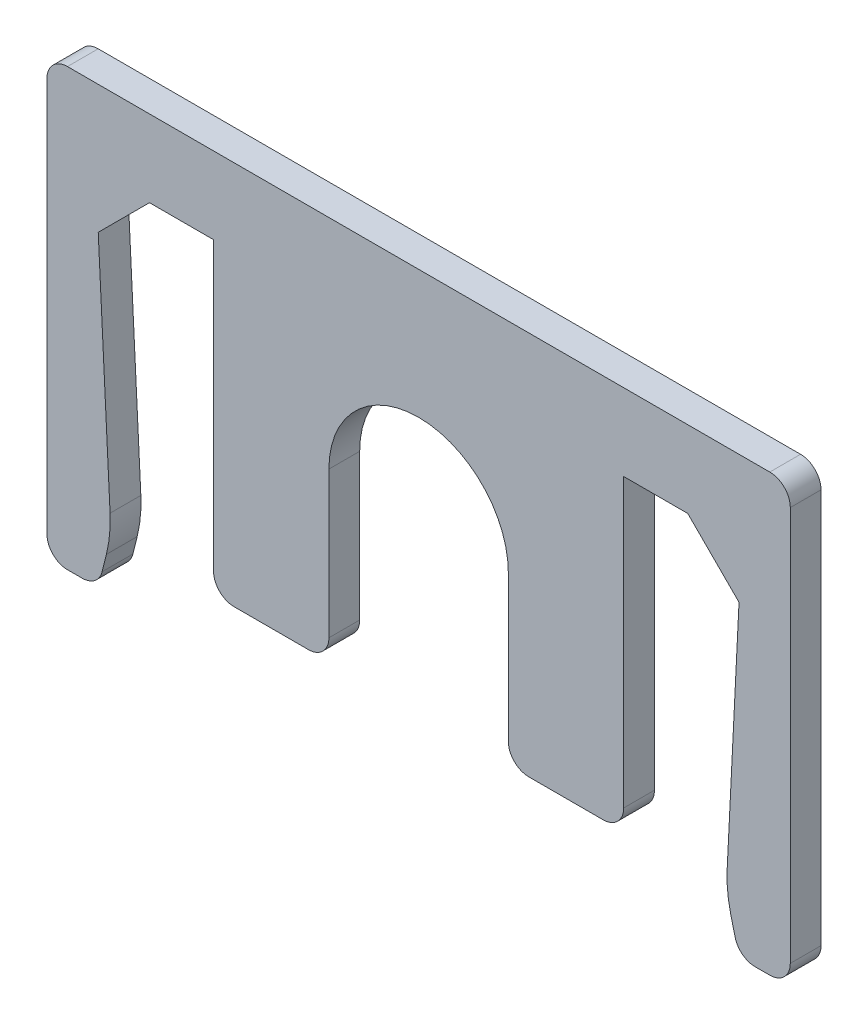
ISO-10303-21;
HEADER;
FILE_DESCRIPTION(('STEP AP214'),'2;1');
FILE_NAME('part.step','',(''),(''),'','','');
FILE_SCHEMA(('AUTOMOTIVE_DESIGN { 1 0 10303 214 1 1 1 1 }'));
ENDSEC;
DATA;
#1=APPLICATION_CONTEXT('core data for automotive mechanical design processes');
#2=APPLICATION_PROTOCOL_DEFINITION('international standard','automotive_design',2000,#1);
#3=PRODUCT_CONTEXT('',#1,'mechanical');
#4=PRODUCT('Part','Part','',(#3));
#5=PRODUCT_RELATED_PRODUCT_CATEGORY('part','',(#4));
#6=PRODUCT_DEFINITION_FORMATION('','',#4);
#7=PRODUCT_DEFINITION_CONTEXT('part definition',#1,'design');
#8=PRODUCT_DEFINITION('design','',#6,#7);
#9=PRODUCT_DEFINITION_SHAPE('','',#8);
#10=(LENGTH_UNIT() NAMED_UNIT(*) SI_UNIT(.MILLI.,.METRE.));
#11=(NAMED_UNIT(*) PLANE_ANGLE_UNIT() SI_UNIT($,.RADIAN.));
#12=(NAMED_UNIT(*) SI_UNIT($,.STERADIAN.) SOLID_ANGLE_UNIT());
#13=UNCERTAINTY_MEASURE_WITH_UNIT(LENGTH_MEASURE(1.E-05),#10,'distance_accuracy_value','');
#14=(GEOMETRIC_REPRESENTATION_CONTEXT(3) GLOBAL_UNCERTAINTY_ASSIGNED_CONTEXT((#13)) GLOBAL_UNIT_ASSIGNED_CONTEXT((#10,
#11,#12)) REPRESENTATION_CONTEXT('',''));
#15=CARTESIAN_POINT('',(0.,0.,0.));
#16=DIRECTION('',(0.,0.,1.));
#17=DIRECTION('',(1.,0.,0.));
#18=AXIS2_PLACEMENT_3D('',#15,#16,#17);
#19=CARTESIAN_POINT('',(-10.5,0.,1.2));
#20=DIRECTION('',(0.,1.,0.));
#21=DIRECTION('',(-1.,0.,0.));
#22=AXIS2_PLACEMENT_3D('',#19,#20,#21);
#23=PLANE('',#22);
#24=DIRECTION('',(1.,0.,0.));
#25=VECTOR('',#24,1.);
#26=CARTESIAN_POINT('',(-10.5,0.,0.));
#27=LINE('',#26,#25);
#28=CARTESIAN_POINT('',(-10.5,0.,0.));
#29=VERTEX_POINT('',#28);
#30=CARTESIAN_POINT('',(-8.,0.,0.));
#31=VERTEX_POINT('',#30);
#32=EDGE_CURVE('E277',#29,#31,#27,.T.);
#33=ORIENTED_EDGE('',*,*,#32,.T.);
#34=DIRECTION('',(0.,0.,-1.));
#35=VECTOR('',#34,1.);
#36=CARTESIAN_POINT('',(-8.,0.,1.2));
#37=LINE('',#36,#35);
#38=CARTESIAN_POINT('',(-8.,0.,1.2));
#39=VERTEX_POINT('',#38);
#40=EDGE_CURVE('E256',#39,#31,#37,.T.);
#41=ORIENTED_EDGE('',*,*,#40,.F.);
#42=DIRECTION('',(1.,0.,0.));
#43=VECTOR('',#42,1.);
#44=CARTESIAN_POINT('',(-10.5,0.,1.2));
#45=LINE('',#44,#43);
#46=CARTESIAN_POINT('',(-10.5,0.,1.2));
#47=VERTEX_POINT('',#46);
#48=EDGE_CURVE('E263',#47,#39,#45,.T.);
#49=ORIENTED_EDGE('',*,*,#48,.F.);
#50=DIRECTION('',(0.,0.,-1.));
#51=VECTOR('',#50,1.);
#52=CARTESIAN_POINT('',(-10.5,0.,1.2));
#53=LINE('',#52,#51);
#54=EDGE_CURVE('E518',#47,#29,#53,.T.);
#55=ORIENTED_EDGE('',*,*,#54,.T.);
#56=EDGE_LOOP('',(#33,#41,#49,#55));
#57=FACE_BOUND('',#56,.T.);
#58=ADVANCED_FACE('F39',(#57),#23,.F.);
#59=CARTESIAN_POINT('',(-8.,-12.,1.2));
#60=DIRECTION('',(1.,0.,0.));
#61=DIRECTION('',(0.,0.,-1.));
#62=AXIS2_PLACEMENT_3D('',#59,#60,#61);
#63=PLANE('',#62);
#64=DIRECTION('',(0.,-1.,0.));
#65=VECTOR('',#64,1.);
#66=CARTESIAN_POINT('',(-8.,-12.,0.));
#67=LINE('',#66,#65);
#68=CARTESIAN_POINT('',(-8.,-11.2,0.));
#69=VERTEX_POINT('',#68);
#70=EDGE_CURVE('E549',#31,#69,#67,.T.);
#71=ORIENTED_EDGE('',*,*,#70,.T.);
#72=DIRECTION('',(0.,0.,-1.));
#73=VECTOR('',#72,1.);
#74=CARTESIAN_POINT('',(-8.,-11.2,1.2));
#75=LINE('',#74,#73);
#76=CARTESIAN_POINT('',(-8.,-11.2,1.2));
#77=VERTEX_POINT('',#76);
#78=EDGE_CURVE('E259',#69,#77,#75,.F.);
#79=ORIENTED_EDGE('',*,*,#78,.T.);
#80=DIRECTION('',(0.,-1.,0.));
#81=VECTOR('',#80,1.);
#82=CARTESIAN_POINT('',(-8.,-12.,1.2));
#83=LINE('',#82,#81);
#84=EDGE_CURVE('E251',#39,#77,#83,.T.);
#85=ORIENTED_EDGE('',*,*,#84,.F.);
#86=ORIENTED_EDGE('',*,*,#40,.T.);
#87=EDGE_LOOP('',(#71,#79,#85,#86));
#88=FACE_BOUND('',#87,.T.);
#89=ADVANCED_FACE('F254',(#88),#63,.F.);
#90=CARTESIAN_POINT('',(-8.,-12.,1.2));
#91=DIRECTION('',(0.,1.,0.));
#92=DIRECTION('',(-1.,0.,0.));
#93=AXIS2_PLACEMENT_3D('',#90,#91,#92);
#94=PLANE('',#93);
#95=DIRECTION('',(1.,0.,0.));
#96=VECTOR('',#95,1.);
#97=CARTESIAN_POINT('',(-8.,-12.,1.2));
#98=LINE('',#97,#96);
#99=CARTESIAN_POINT('',(-7.2,-12.,1.2));
#100=VERTEX_POINT('',#99);
#101=CARTESIAN_POINT('',(-4.3,-12.,1.2));
#102=VERTEX_POINT('',#101);
#103=EDGE_CURVE('E262',#100,#102,#98,.T.);
#104=ORIENTED_EDGE('',*,*,#103,.F.);
#105=DIRECTION('',(0.,0.,-1.));
#106=VECTOR('',#105,1.);
#107=CARTESIAN_POINT('',(-7.2,-12.,1.2));
#108=LINE('',#107,#106);
#109=CARTESIAN_POINT('',(-7.2,-12.,0.));
#110=VERTEX_POINT('',#109);
#111=EDGE_CURVE('E418',#100,#110,#108,.T.);
#112=ORIENTED_EDGE('',*,*,#111,.T.);
#113=DIRECTION('',(1.,0.,0.));
#114=VECTOR('',#113,1.);
#115=CARTESIAN_POINT('',(-8.,-12.,0.));
#116=LINE('',#115,#114);
#117=CARTESIAN_POINT('',(-4.3,-12.,0.));
#118=VERTEX_POINT('',#117);
#119=EDGE_CURVE('E543',#110,#118,#116,.T.);
#120=ORIENTED_EDGE('',*,*,#119,.T.);
#121=DIRECTION('',(0.,0.,-1.));
#122=VECTOR('',#121,1.);
#123=CARTESIAN_POINT('',(-4.3,-12.,1.2));
#124=LINE('',#123,#122);
#125=EDGE_CURVE('E415',#118,#102,#124,.F.);
#126=ORIENTED_EDGE('',*,*,#125,.T.);
#127=EDGE_LOOP('',(#104,#112,#120,#126));
#128=FACE_BOUND('',#127,.T.);
#129=ADVANCED_FACE('F624',(#128),#94,.F.);
#130=CARTESIAN_POINT('',(-3.5,-5.5,1.2));
#131=DIRECTION('',(-1.,0.,0.));
#132=DIRECTION('',(0.,-1.,0.));
#133=AXIS2_PLACEMENT_3D('',#130,#131,#132);
#134=PLANE('',#133);
#135=DIRECTION('',(0.,1.,0.));
#136=VECTOR('',#135,1.);
#137=CARTESIAN_POINT('',(-3.5,-5.5,1.2));
#138=LINE('',#137,#136);
#139=CARTESIAN_POINT('',(-3.5,-11.2,1.2));
#140=VERTEX_POINT('',#139);
#141=CARTESIAN_POINT('',(-3.5,-5.5,1.2));
#142=VERTEX_POINT('',#141);
#143=EDGE_CURVE('E600',#140,#142,#138,.T.);
#144=ORIENTED_EDGE('',*,*,#143,.F.);
#145=DIRECTION('',(0.,0.,-1.));
#146=VECTOR('',#145,1.);
#147=CARTESIAN_POINT('',(-3.5,-11.2,1.2));
#148=LINE('',#147,#146);
#149=CARTESIAN_POINT('',(-3.5,-11.2,0.));
#150=VERTEX_POINT('',#149);
#151=EDGE_CURVE('E11',#140,#150,#148,.T.);
#152=ORIENTED_EDGE('',*,*,#151,.T.);
#153=DIRECTION('',(0.,1.,0.));
#154=VECTOR('',#153,1.);
#155=CARTESIAN_POINT('',(-3.5,-5.5,0.));
#156=LINE('',#155,#154);
#157=CARTESIAN_POINT('',(-3.5,-5.5,0.));
#158=VERTEX_POINT('',#157);
#159=EDGE_CURVE('E540',#150,#158,#156,.T.);
#160=ORIENTED_EDGE('',*,*,#159,.T.);
#161=DIRECTION('',(0.,0.,-1.));
#162=VECTOR('',#161,1.);
#163=CARTESIAN_POINT('',(-3.5,-5.5,1.2));
#164=LINE('',#163,#162);
#165=EDGE_CURVE('E280',#142,#158,#164,.T.);
#166=ORIENTED_EDGE('',*,*,#165,.F.);
#167=EDGE_LOOP('',(#144,#152,#160,#166));
#168=FACE_BOUND('',#167,.T.);
#169=ADVANCED_FACE('F614',(#168),#134,.F.);
#170=CARTESIAN_POINT('',(0.,-5.5,1.2));
#171=DIRECTION('',(0.,0.,-1.));
#172=DIRECTION('',(-1.,0.,0.));
#173=AXIS2_PLACEMENT_3D('',#170,#171,#172);
#174=CYLINDRICAL_SURFACE('',#173,3.5);
#175=CARTESIAN_POINT('',(0.,-5.5,0.));
#176=DIRECTION('',(0.,0.,-1.));
#177=DIRECTION('',(1.,0.,0.));
#178=AXIS2_PLACEMENT_3D('',#175,#176,#177);
#179=CIRCLE('',#178,3.5);
#180=CARTESIAN_POINT('',(3.5,-5.5,0.));
#181=VERTEX_POINT('',#180);
#182=EDGE_CURVE('E474',#158,#181,#179,.T.);
#183=ORIENTED_EDGE('',*,*,#182,.T.);
#184=DIRECTION('',(0.,0.,-1.));
#185=VECTOR('',#184,1.);
#186=CARTESIAN_POINT('',(3.5,-5.5,1.2));
#187=LINE('',#186,#185);
#188=CARTESIAN_POINT('',(3.5,-5.5,1.2));
#189=VERTEX_POINT('',#188);
#190=EDGE_CURVE('E288',#189,#181,#187,.T.);
#191=ORIENTED_EDGE('',*,*,#190,.F.);
#192=CARTESIAN_POINT('',(0.,-5.5,1.2));
#193=DIRECTION('',(0.,0.,-1.));
#194=DIRECTION('',(1.,0.,0.));
#195=AXIS2_PLACEMENT_3D('',#192,#193,#194);
#196=CIRCLE('',#195,3.5);
#197=EDGE_CURVE('E450',#142,#189,#196,.T.);
#198=ORIENTED_EDGE('',*,*,#197,.F.);
#199=ORIENTED_EDGE('',*,*,#165,.T.);
#200=EDGE_LOOP('',(#183,#191,#198,#199));
#201=FACE_BOUND('',#200,.T.);
#202=ADVANCED_FACE('F616',(#201),#174,.F.);
#203=CARTESIAN_POINT('',(3.5,-5.5,1.2));
#204=DIRECTION('',(1.,0.,0.));
#205=DIRECTION('',(0.,1.,0.));
#206=AXIS2_PLACEMENT_3D('',#203,#204,#205);
#207=PLANE('',#206);
#208=DIRECTION('',(0.,-1.,0.));
#209=VECTOR('',#208,1.);
#210=CARTESIAN_POINT('',(3.5,-5.5,0.));
#211=LINE('',#210,#209);
#212=CARTESIAN_POINT('',(3.5,-11.2,0.));
#213=VERTEX_POINT('',#212);
#214=EDGE_CURVE('E444',#181,#213,#211,.T.);
#215=ORIENTED_EDGE('',*,*,#214,.T.);
#216=DIRECTION('',(0.,0.,-1.));
#217=VECTOR('',#216,1.);
#218=CARTESIAN_POINT('',(3.5,-11.2,1.2));
#219=LINE('',#218,#217);
#220=CARTESIAN_POINT('',(3.5,-11.2,1.2));
#221=VERTEX_POINT('',#220);
#222=EDGE_CURVE('E48',#213,#221,#219,.F.);
#223=ORIENTED_EDGE('',*,*,#222,.T.);
#224=DIRECTION('',(0.,-1.,0.));
#225=VECTOR('',#224,1.);
#226=CARTESIAN_POINT('',(3.5,-5.5,1.2));
#227=LINE('',#226,#225);
#228=EDGE_CURVE('E442',#189,#221,#227,.T.);
#229=ORIENTED_EDGE('',*,*,#228,.F.);
#230=ORIENTED_EDGE('',*,*,#190,.T.);
#231=EDGE_LOOP('',(#215,#223,#229,#230));
#232=FACE_BOUND('',#231,.T.);
#233=ADVANCED_FACE('F440',(#232),#207,.F.);
#234=CARTESIAN_POINT('',(3.5,-12.,1.2));
#235=DIRECTION('',(0.,1.,0.));
#236=DIRECTION('',(-1.,0.,0.));
#237=AXIS2_PLACEMENT_3D('',#234,#235,#236);
#238=PLANE('',#237);
#239=DIRECTION('',(1.,0.,0.));
#240=VECTOR('',#239,1.);
#241=CARTESIAN_POINT('',(3.5,-12.,0.));
#242=LINE('',#241,#240);
#243=CARTESIAN_POINT('',(4.3,-12.,0.));
#244=VERTEX_POINT('',#243);
#245=CARTESIAN_POINT('',(7.2,-12.,0.));
#246=VERTEX_POINT('',#245);
#247=EDGE_CURVE('E461',#244,#246,#242,.T.);
#248=ORIENTED_EDGE('',*,*,#247,.T.);
#249=DIRECTION('',(0.,0.,-1.));
#250=VECTOR('',#249,1.);
#251=CARTESIAN_POINT('',(7.2,-12.,1.2));
#252=LINE('',#251,#250);
#253=CARTESIAN_POINT('',(7.2,-12.,1.2));
#254=VERTEX_POINT('',#253);
#255=EDGE_CURVE('E432',#246,#254,#252,.F.);
#256=ORIENTED_EDGE('',*,*,#255,.T.);
#257=DIRECTION('',(1.,0.,0.));
#258=VECTOR('',#257,1.);
#259=CARTESIAN_POINT('',(3.5,-12.,1.2));
#260=LINE('',#259,#258);
#261=CARTESIAN_POINT('',(4.3,-12.,1.2));
#262=VERTEX_POINT('',#261);
#263=EDGE_CURVE('E453',#262,#254,#260,.T.);
#264=ORIENTED_EDGE('',*,*,#263,.F.);
#265=DIRECTION('',(0.,0.,-1.));
#266=VECTOR('',#265,1.);
#267=CARTESIAN_POINT('',(4.3,-12.,1.2));
#268=LINE('',#267,#266);
#269=EDGE_CURVE('E428',#262,#244,#268,.T.);
#270=ORIENTED_EDGE('',*,*,#269,.T.);
#271=EDGE_LOOP('',(#248,#256,#264,#270));
#272=FACE_BOUND('',#271,.T.);
#273=ADVANCED_FACE('F460',(#272),#238,.F.);
#274=CARTESIAN_POINT('',(8.,-12.,1.2));
#275=DIRECTION('',(-1.,0.,0.));
#276=DIRECTION('',(0.,0.,1.));
#277=AXIS2_PLACEMENT_3D('',#274,#275,#276);
#278=PLANE('',#277);
#279=DIRECTION('',(0.,1.,0.));
#280=VECTOR('',#279,1.);
#281=CARTESIAN_POINT('',(8.,-12.,1.2));
#282=LINE('',#281,#280);
#283=CARTESIAN_POINT('',(8.,-11.2,1.2));
#284=VERTEX_POINT('',#283);
#285=CARTESIAN_POINT('',(8.,0.,1.2));
#286=VERTEX_POINT('',#285);
#287=EDGE_CURVE('E593',#284,#286,#282,.T.);
#288=ORIENTED_EDGE('',*,*,#287,.F.);
#289=DIRECTION('',(0.,0.,-1.));
#290=VECTOR('',#289,1.);
#291=CARTESIAN_POINT('',(8.,-11.2,1.2));
#292=LINE('',#291,#290);
#293=CARTESIAN_POINT('',(8.,-11.2,0.));
#294=VERTEX_POINT('',#293);
#295=EDGE_CURVE('E424',#284,#294,#292,.T.);
#296=ORIENTED_EDGE('',*,*,#295,.T.);
#297=DIRECTION('',(0.,1.,0.));
#298=VECTOR('',#297,1.);
#299=CARTESIAN_POINT('',(8.,-12.,0.));
#300=LINE('',#299,#298);
#301=CARTESIAN_POINT('',(8.,0.,0.));
#302=VERTEX_POINT('',#301);
#303=EDGE_CURVE('E468',#294,#302,#300,.T.);
#304=ORIENTED_EDGE('',*,*,#303,.T.);
#305=DIRECTION('',(0.,0.,-1.));
#306=VECTOR('',#305,1.);
#307=CARTESIAN_POINT('',(8.,0.,1.2));
#308=LINE('',#307,#306);
#309=EDGE_CURVE('E533',#286,#302,#308,.T.);
#310=ORIENTED_EDGE('',*,*,#309,.F.);
#311=EDGE_LOOP('',(#288,#296,#304,#310));
#312=FACE_BOUND('',#311,.T.);
#313=ADVANCED_FACE('F834',(#312),#278,.F.);
#314=CARTESIAN_POINT('',(8.,0.,1.2));
#315=DIRECTION('',(0.,1.,0.));
#316=DIRECTION('',(-1.,0.,0.));
#317=AXIS2_PLACEMENT_3D('',#314,#315,#316);
#318=PLANE('',#317);
#319=DIRECTION('',(1.,0.,0.));
#320=VECTOR('',#319,1.);
#321=CARTESIAN_POINT('',(8.,0.,0.));
#322=LINE('',#321,#320);
#323=CARTESIAN_POINT('',(10.5,0.,0.));
#324=VERTEX_POINT('',#323);
#325=EDGE_CURVE('E472',#302,#324,#322,.T.);
#326=ORIENTED_EDGE('',*,*,#325,.T.);
#327=DIRECTION('',(0.,0.,-1.));
#328=VECTOR('',#327,1.);
#329=CARTESIAN_POINT('',(10.5,0.,1.2));
#330=LINE('',#329,#328);
#331=CARTESIAN_POINT('',(10.5,0.,1.2));
#332=VERTEX_POINT('',#331);
#333=EDGE_CURVE('E529',#332,#324,#330,.T.);
#334=ORIENTED_EDGE('',*,*,#333,.F.);
#335=DIRECTION('',(1.,0.,0.));
#336=VECTOR('',#335,1.);
#337=CARTESIAN_POINT('',(8.,0.,1.2));
#338=LINE('',#337,#336);
#339=EDGE_CURVE('E590',#286,#332,#338,.T.);
#340=ORIENTED_EDGE('',*,*,#339,.F.);
#341=ORIENTED_EDGE('',*,*,#309,.T.);
#342=EDGE_LOOP('',(#326,#334,#340,#341));
#343=FACE_BOUND('',#342,.T.);
#344=ADVANCED_FACE('F839',(#343),#318,.F.);
#345=CARTESIAN_POINT('',(12.5,-2.,1.2));
#346=DIRECTION('',(0.707106781186547,0.707106781186548,0.));
#347=DIRECTION('',(-0.707106781186548,0.707106781186547,0.));
#348=AXIS2_PLACEMENT_3D('',#345,#346,#347);
#349=PLANE('',#348);
#350=DIRECTION('',(0.707106781186548,-0.707106781186547,0.));
#351=VECTOR('',#350,1.);
#352=CARTESIAN_POINT('',(12.5,-2.,0.));
#353=LINE('',#352,#351);
#354=CARTESIAN_POINT('',(12.5,-2.,0.));
#355=VERTEX_POINT('',#354);
#356=EDGE_CURVE('E480',#324,#355,#353,.T.);
#357=ORIENTED_EDGE('',*,*,#356,.T.);
#358=DIRECTION('',(0.,0.,-1.));
#359=VECTOR('',#358,1.);
#360=CARTESIAN_POINT('',(12.5,-2.,1.2));
#361=LINE('',#360,#359);
#362=CARTESIAN_POINT('',(12.5,-2.,1.2));
#363=VERTEX_POINT('',#362);
#364=EDGE_CURVE('E525',#363,#355,#361,.T.);
#365=ORIENTED_EDGE('',*,*,#364,.F.);
#366=DIRECTION('',(0.707106781186548,-0.707106781186547,0.));
#367=VECTOR('',#366,1.);
#368=CARTESIAN_POINT('',(12.5,-2.,1.2));
#369=LINE('',#368,#367);
#370=EDGE_CURVE('E587',#332,#363,#369,.T.);
#371=ORIENTED_EDGE('',*,*,#370,.F.);
#372=ORIENTED_EDGE('',*,*,#333,.T.);
#373=EDGE_LOOP('',(#357,#365,#371,#372));
#374=FACE_BOUND('',#373,.T.);
#375=ADVANCED_FACE('F901',(#374),#349,.F.);
#376=CARTESIAN_POINT('',(12.,-12.,1.2));
#377=DIRECTION('',(0.998752338877844,-0.0499376169438947,0.));
#378=DIRECTION('',(0.0499376169438947,0.998752338877845,0.));
#379=AXIS2_PLACEMENT_3D('',#376,#377,#378);
#380=PLANE('',#379);
#381=DIRECTION('',(-0.0499376169438947,-0.998752338877845,0.));
#382=VECTOR('',#381,1.);
#383=CARTESIAN_POINT('',(12.,-12.,0.));
#384=LINE('',#383,#382);
#385=CARTESIAN_POINT('',(12.0370903931354,-11.2581921372909,0.));
#386=VERTEX_POINT('',#385);
#387=EDGE_CURVE('E483',#355,#386,#384,.T.);
#388=ORIENTED_EDGE('',*,*,#387,.T.);
#389=DIRECTION('',(0.,0.,-1.));
#390=VECTOR('',#389,1.);
#391=CARTESIAN_POINT('',(12.0370903931354,-11.2581921372909,1.2));
#392=LINE('',#391,#390);
#393=CARTESIAN_POINT('',(12.0370903931354,-11.2581921372909,1.2));
#394=VERTEX_POINT('',#393);
#395=EDGE_CURVE('E312',#386,#394,#392,.F.);
#396=ORIENTED_EDGE('',*,*,#395,.T.);
#397=DIRECTION('',(-0.0499376169438947,-0.998752338877845,0.));
#398=VECTOR('',#397,1.);
#399=CARTESIAN_POINT('',(12.,-12.,1.2));
#400=LINE('',#399,#398);
#401=EDGE_CURVE('E583',#363,#394,#400,.T.);
#402=ORIENTED_EDGE('',*,*,#401,.F.);
#403=ORIENTED_EDGE('',*,*,#364,.T.);
#404=EDGE_LOOP('',(#388,#396,#402,#403));
#405=FACE_BOUND('',#404,.T.);
#406=ADVANCED_FACE('F826',(#405),#380,.F.);
#407=CARTESIAN_POINT('',(12.5,-14.,1.2));
#408=DIRECTION('',(0.970142500145332,0.242535625036332,0.));
#409=DIRECTION('',(-0.242535625036332,0.970142500145332,0.));
#410=AXIS2_PLACEMENT_3D('',#407,#408,#409);
#411=PLANE('',#410);
#412=DIRECTION('',(0.242535625036332,-0.970142500145332,0.));
#413=VECTOR('',#412,1.);
#414=CARTESIAN_POINT('',(12.5,-14.,0.));
#415=LINE('',#414,#413);
#416=CARTESIAN_POINT('',(12.180139586798,-12.7205583471921,0.));
#417=VERTEX_POINT('',#416);
#418=CARTESIAN_POINT('',(12.3485071250072,-13.3940285000291,0.));
#419=VERTEX_POINT('',#418);
#420=EDGE_CURVE('E487',#417,#419,#415,.T.);
#421=ORIENTED_EDGE('',*,*,#420,.T.);
#422=DIRECTION('',(0.,0.,-1.));
#423=VECTOR('',#422,1.);
#424=CARTESIAN_POINT('',(12.3485071250072,-13.3940285000291,1.2));
#425=LINE('',#424,#423);
#426=CARTESIAN_POINT('',(12.3485071250072,-13.3940285000291,1.2));
#427=VERTEX_POINT('',#426);
#428=EDGE_CURVE('E408',#419,#427,#425,.F.);
#429=ORIENTED_EDGE('',*,*,#428,.T.);
#430=DIRECTION('',(0.242535625036332,-0.970142500145332,0.));
#431=VECTOR('',#430,1.);
#432=CARTESIAN_POINT('',(12.5,-14.,1.2));
#433=LINE('',#432,#431);
#434=CARTESIAN_POINT('',(12.180139586798,-12.7205583471921,1.2));
#435=VERTEX_POINT('',#434);
#436=EDGE_CURVE('E579',#435,#427,#433,.T.);
#437=ORIENTED_EDGE('',*,*,#436,.F.);
#438=DIRECTION('',(0.,0.,-1.));
#439=VECTOR('',#438,1.);
#440=CARTESIAN_POINT('',(12.180139586798,-12.7205583471921,1.2));
#441=LINE('',#440,#439);
#442=EDGE_CURVE('E308',#435,#417,#441,.T.);
#443=ORIENTED_EDGE('',*,*,#442,.T.);
#444=EDGE_LOOP('',(#421,#429,#437,#443));
#445=FACE_BOUND('',#444,.T.);
#446=ADVANCED_FACE('F816',(#445),#411,.F.);
#447=CARTESIAN_POINT('',(12.5,-14.,1.2));
#448=DIRECTION('',(0.,1.,0.));
#449=DIRECTION('',(0.,0.,1.));
#450=AXIS2_PLACEMENT_3D('',#447,#448,#449);
#451=PLANE('',#450);
#452=DIRECTION('',(1.,0.,0.));
#453=VECTOR('',#452,1.);
#454=CARTESIAN_POINT('',(12.5,-14.,0.));
#455=LINE('',#454,#453);
#456=CARTESIAN_POINT('',(13.1246211251235,-14.,0.));
#457=VERTEX_POINT('',#456);
#458=CARTESIAN_POINT('',(13.7,-14.,0.));
#459=VERTEX_POINT('',#458);
#460=EDGE_CURVE('E491',#457,#459,#455,.T.);
#461=ORIENTED_EDGE('',*,*,#460,.T.);
#462=DIRECTION('',(0.,0.,-1.));
#463=VECTOR('',#462,1.);
#464=CARTESIAN_POINT('',(13.7,-14.,1.2));
#465=LINE('',#464,#463);
#466=CARTESIAN_POINT('',(13.7,-14.,1.2));
#467=VERTEX_POINT('',#466);
#468=EDGE_CURVE('E399',#459,#467,#465,.F.);
#469=ORIENTED_EDGE('',*,*,#468,.T.);
#470=DIRECTION('',(1.,0.,0.));
#471=VECTOR('',#470,1.);
#472=CARTESIAN_POINT('',(12.5,-14.,1.2));
#473=LINE('',#472,#471);
#474=CARTESIAN_POINT('',(13.1246211251235,-14.,1.2));
#475=VERTEX_POINT('',#474);
#476=EDGE_CURVE('E575',#475,#467,#473,.T.);
#477=ORIENTED_EDGE('',*,*,#476,.F.);
#478=DIRECTION('',(0.,0.,-1.));
#479=VECTOR('',#478,1.);
#480=CARTESIAN_POINT('',(13.1246211251235,-14.,1.2));
#481=LINE('',#480,#479);
#482=EDGE_CURVE('E395',#475,#457,#481,.T.);
#483=ORIENTED_EDGE('',*,*,#482,.T.);
#484=EDGE_LOOP('',(#461,#469,#477,#483));
#485=FACE_BOUND('',#484,.T.);
#486=ADVANCED_FACE('F805',(#485),#451,.F.);
#487=CARTESIAN_POINT('',(14.5,-14.,1.2));
#488=DIRECTION('',(-1.,0.,0.));
#489=DIRECTION('',(0.,0.,1.));
#490=AXIS2_PLACEMENT_3D('',#487,#488,#489);
#491=PLANE('',#490);
#492=DIRECTION('',(0.,1.,0.));
#493=VECTOR('',#492,1.);
#494=CARTESIAN_POINT('',(14.5,-14.,0.));
#495=LINE('',#494,#493);
#496=CARTESIAN_POINT('',(14.5,-13.2,0.));
#497=VERTEX_POINT('',#496);
#498=CARTESIAN_POINT('',(14.5,2.2,0.));
#499=VERTEX_POINT('',#498);
#500=EDGE_CURVE('E495',#497,#499,#495,.T.);
#501=ORIENTED_EDGE('',*,*,#500,.T.);
#502=DIRECTION('',(0.,0.,-1.));
#503=VECTOR('',#502,1.);
#504=CARTESIAN_POINT('',(14.5,2.2,1.2));
#505=LINE('',#504,#503);
#506=CARTESIAN_POINT('',(14.5,2.2,1.2));
#507=VERTEX_POINT('',#506);
#508=EDGE_CURVE('E356',#499,#507,#505,.F.);
#509=ORIENTED_EDGE('',*,*,#508,.T.);
#510=DIRECTION('',(0.,1.,0.));
#511=VECTOR('',#510,1.);
#512=CARTESIAN_POINT('',(14.5,-14.,1.2));
#513=LINE('',#512,#511);
#514=CARTESIAN_POINT('',(14.5,-13.2,1.2));
#515=VERTEX_POINT('',#514);
#516=EDGE_CURVE('E572',#515,#507,#513,.T.);
#517=ORIENTED_EDGE('',*,*,#516,.F.);
#518=DIRECTION('',(0.,0.,-1.));
#519=VECTOR('',#518,1.);
#520=CARTESIAN_POINT('',(14.5,-13.2,1.2));
#521=LINE('',#520,#519);
#522=EDGE_CURVE('E352',#515,#497,#521,.T.);
#523=ORIENTED_EDGE('',*,*,#522,.T.);
#524=EDGE_LOOP('',(#501,#509,#517,#523));
#525=FACE_BOUND('',#524,.T.);
#526=ADVANCED_FACE('F794',(#525),#491,.F.);
#527=CARTESIAN_POINT('',(-12.5,3.,1.2));
#528=DIRECTION('',(0.,-1.,0.));
#529=DIRECTION('',(1.,0.,0.));
#530=AXIS2_PLACEMENT_3D('',#527,#528,#529);
#531=PLANE('',#530);
#532=DIRECTION('',(-1.,0.,0.));
#533=VECTOR('',#532,1.);
#534=CARTESIAN_POINT('',(12.5,3.,1.2));
#535=LINE('',#534,#533);
#536=CARTESIAN_POINT('',(13.7,3.,1.2));
#537=VERTEX_POINT('',#536);
#538=CARTESIAN_POINT('',(-13.7,3.,1.2));
#539=VERTEX_POINT('',#538);
#540=EDGE_CURVE('E568',#537,#539,#535,.T.);
#541=ORIENTED_EDGE('',*,*,#540,.F.);
#542=DIRECTION('',(0.,0.,-1.));
#543=VECTOR('',#542,1.);
#544=CARTESIAN_POINT('',(13.7,3.,1.2));
#545=LINE('',#544,#543);
#546=CARTESIAN_POINT('',(13.7,3.,0.));
#547=VERTEX_POINT('',#546);
#548=EDGE_CURVE('E318',#537,#547,#545,.T.);
#549=ORIENTED_EDGE('',*,*,#548,.T.);
#550=DIRECTION('',(-1.,0.,0.));
#551=VECTOR('',#550,1.);
#552=CARTESIAN_POINT('',(-12.5,3.,0.));
#553=LINE('',#552,#551);
#554=CARTESIAN_POINT('',(-13.7,3.,0.));
#555=VERTEX_POINT('',#554);
#556=EDGE_CURVE('E499',#547,#555,#553,.T.);
#557=ORIENTED_EDGE('',*,*,#556,.T.);
#558=DIRECTION('',(0.,0.,-1.));
#559=VECTOR('',#558,1.);
#560=CARTESIAN_POINT('',(-13.7,3.,1.2));
#561=LINE('',#560,#559);
#562=EDGE_CURVE('E315',#555,#539,#561,.F.);
#563=ORIENTED_EDGE('',*,*,#562,.T.);
#564=EDGE_LOOP('',(#541,#549,#557,#563));
#565=FACE_BOUND('',#564,.T.);
#566=ADVANCED_FACE('F784',(#565),#531,.F.);
#567=CARTESIAN_POINT('',(-14.5,-14.,1.2));
#568=DIRECTION('',(1.,0.,0.));
#569=DIRECTION('',(0.,0.,-1.));
#570=AXIS2_PLACEMENT_3D('',#567,#568,#569);
#571=PLANE('',#570);
#572=DIRECTION('',(0.,-1.,0.));
#573=VECTOR('',#572,1.);
#574=CARTESIAN_POINT('',(-14.5,-14.,1.2));
#575=LINE('',#574,#573);
#576=CARTESIAN_POINT('',(-14.5,2.2,1.2));
#577=VERTEX_POINT('',#576);
#578=CARTESIAN_POINT('',(-14.5,-13.2,1.2));
#579=VERTEX_POINT('',#578);
#580=EDGE_CURVE('E565',#577,#579,#575,.T.);
#581=ORIENTED_EDGE('',*,*,#580,.F.);
#582=DIRECTION('',(0.,0.,-1.));
#583=VECTOR('',#582,1.);
#584=CARTESIAN_POINT('',(-14.5,2.2,1.2));
#585=LINE('',#584,#583);
#586=CARTESIAN_POINT('',(-14.5,2.2,0.));
#587=VERTEX_POINT('',#586);
#588=EDGE_CURVE('E391',#577,#587,#585,.T.);
#589=ORIENTED_EDGE('',*,*,#588,.T.);
#590=DIRECTION('',(0.,-1.,0.));
#591=VECTOR('',#590,1.);
#592=CARTESIAN_POINT('',(-14.5,-14.,0.));
#593=LINE('',#592,#591);
#594=CARTESIAN_POINT('',(-14.5,-13.2,0.));
#595=VERTEX_POINT('',#594);
#596=EDGE_CURVE('E503',#587,#595,#593,.T.);
#597=ORIENTED_EDGE('',*,*,#596,.T.);
#598=DIRECTION('',(0.,0.,-1.));
#599=VECTOR('',#598,1.);
#600=CARTESIAN_POINT('',(-14.5,-13.2,1.2));
#601=LINE('',#600,#599);
#602=EDGE_CURVE('E388',#595,#579,#601,.F.);
#603=ORIENTED_EDGE('',*,*,#602,.T.);
#604=EDGE_LOOP('',(#581,#589,#597,#603));
#605=FACE_BOUND('',#604,.T.);
#606=ADVANCED_FACE('F775',(#605),#571,.F.);
#607=CARTESIAN_POINT('',(-12.5,-14.,1.2));
#608=DIRECTION('',(0.,1.,0.));
#609=DIRECTION('',(0.,0.,1.));
#610=AXIS2_PLACEMENT_3D('',#607,#608,#609);
#611=PLANE('',#610);
#612=DIRECTION('',(1.,0.,0.));
#613=VECTOR('',#612,1.);
#614=CARTESIAN_POINT('',(-12.5,-14.,1.2));
#615=LINE('',#614,#613);
#616=CARTESIAN_POINT('',(-13.7,-14.,1.2));
#617=VERTEX_POINT('',#616);
#618=CARTESIAN_POINT('',(-13.1246211251235,-14.,1.2));
#619=VERTEX_POINT('',#618);
#620=EDGE_CURVE('E562',#617,#619,#615,.T.);
#621=ORIENTED_EDGE('',*,*,#620,.F.);
#622=DIRECTION('',(0.,0.,-1.));
#623=VECTOR('',#622,1.);
#624=CARTESIAN_POINT('',(-13.7,-14.,1.2));
#625=LINE('',#624,#623);
#626=CARTESIAN_POINT('',(-13.7,-14.,0.));
#627=VERTEX_POINT('',#626);
#628=EDGE_CURVE('E404',#617,#627,#625,.T.);
#629=ORIENTED_EDGE('',*,*,#628,.T.);
#630=DIRECTION('',(1.,0.,0.));
#631=VECTOR('',#630,1.);
#632=CARTESIAN_POINT('',(-12.5,-14.,0.));
#633=LINE('',#632,#631);
#634=CARTESIAN_POINT('',(-13.1246211251235,-14.,0.));
#635=VERTEX_POINT('',#634);
#636=EDGE_CURVE('E507',#627,#635,#633,.T.);
#637=ORIENTED_EDGE('',*,*,#636,.T.);
#638=DIRECTION('',(0.,0.,-1.));
#639=VECTOR('',#638,1.);
#640=CARTESIAN_POINT('',(-13.1246211251235,-14.,1.2));
#641=LINE('',#640,#639);
#642=EDGE_CURVE('E55',#635,#619,#641,.F.);
#643=ORIENTED_EDGE('',*,*,#642,.T.);
#644=EDGE_LOOP('',(#621,#629,#637,#643));
#645=FACE_BOUND('',#644,.T.);
#646=ADVANCED_FACE('F763',(#645),#611,.F.);
#647=CARTESIAN_POINT('',(-12.,-12.,1.2));
#648=DIRECTION('',(-0.970142500145332,0.242535625036333,0.));
#649=DIRECTION('',(-0.242535625036333,-0.970142500145332,0.));
#650=AXIS2_PLACEMENT_3D('',#647,#648,#649);
#651=PLANE('',#650);
#652=DIRECTION('',(0.242535625036333,0.970142500145332,0.));
#653=VECTOR('',#652,1.);
#654=CARTESIAN_POINT('',(-12.,-12.,1.2));
#655=LINE('',#654,#653);
#656=CARTESIAN_POINT('',(-12.3485071250073,-13.3940285000291,1.2));
#657=VERTEX_POINT('',#656);
#658=CARTESIAN_POINT('',(-12.180139586798,-12.7205583471921,1.2));
#659=VERTEX_POINT('',#658);
#660=EDGE_CURVE('E559',#657,#659,#655,.T.);
#661=ORIENTED_EDGE('',*,*,#660,.F.);
#662=DIRECTION('',(0.,0.,-1.));
#663=VECTOR('',#662,1.);
#664=CARTESIAN_POINT('',(-12.3485071250073,-13.3940285000291,1.2));
#665=LINE('',#664,#663);
#666=CARTESIAN_POINT('',(-12.3485071250073,-13.3940285000291,0.));
#667=VERTEX_POINT('',#666);
#668=EDGE_CURVE('E411',#657,#667,#665,.T.);
#669=ORIENTED_EDGE('',*,*,#668,.T.);
#670=DIRECTION('',(0.242535625036333,0.970142500145332,0.));
#671=VECTOR('',#670,1.);
#672=CARTESIAN_POINT('',(-12.,-12.,0.));
#673=LINE('',#672,#671);
#674=CARTESIAN_POINT('',(-12.180139586798,-12.7205583471921,0.));
#675=VERTEX_POINT('',#674);
#676=EDGE_CURVE('E510',#667,#675,#673,.T.);
#677=ORIENTED_EDGE('',*,*,#676,.T.);
#678=DIRECTION('',(0.,0.,-1.));
#679=VECTOR('',#678,1.);
#680=CARTESIAN_POINT('',(-12.180139586798,-12.7205583471921,1.2));
#681=LINE('',#680,#679);
#682=EDGE_CURVE('E298',#675,#659,#681,.F.);
#683=ORIENTED_EDGE('',*,*,#682,.T.);
#684=EDGE_LOOP('',(#661,#669,#677,#683));
#685=FACE_BOUND('',#684,.T.);
#686=ADVANCED_FACE('F757',(#685),#651,.F.);
#687=CARTESIAN_POINT('',(-12.5,-2.,1.2));
#688=DIRECTION('',(-0.998752338877845,-0.0499376169438921,0.));
#689=DIRECTION('',(0.0499376169438921,-0.998752338877845,0.));
#690=AXIS2_PLACEMENT_3D('',#687,#688,#689);
#691=PLANE('',#690);
#692=DIRECTION('',(-0.0499376169438921,0.998752338877845,0.));
#693=VECTOR('',#692,1.);
#694=CARTESIAN_POINT('',(-12.5,-2.,1.2));
#695=LINE('',#694,#693);
#696=CARTESIAN_POINT('',(-12.0370903931355,-11.2581921372909,1.2));
#697=VERTEX_POINT('',#696);
#698=CARTESIAN_POINT('',(-12.5,-2.,1.2));
#699=VERTEX_POINT('',#698);
#700=EDGE_CURVE('E556',#697,#699,#695,.T.);
#701=ORIENTED_EDGE('',*,*,#700,.F.);
#702=DIRECTION('',(0.,0.,-1.));
#703=VECTOR('',#702,1.);
#704=CARTESIAN_POINT('',(-12.0370903931355,-11.2581921372909,1.2));
#705=LINE('',#704,#703);
#706=CARTESIAN_POINT('',(-12.0370903931355,-11.2581921372909,0.));
#707=VERTEX_POINT('',#706);
#708=EDGE_CURVE('E279',#697,#707,#705,.T.);
#709=ORIENTED_EDGE('',*,*,#708,.T.);
#710=DIRECTION('',(-0.0499376169438921,0.998752338877845,0.));
#711=VECTOR('',#710,1.);
#712=CARTESIAN_POINT('',(-12.5,-2.,0.));
#713=LINE('',#712,#711);
#714=CARTESIAN_POINT('',(-12.5,-2.,0.));
#715=VERTEX_POINT('',#714);
#716=EDGE_CURVE('E513',#707,#715,#713,.T.);
#717=ORIENTED_EDGE('',*,*,#716,.T.);
#718=DIRECTION('',(0.,0.,-1.));
#719=VECTOR('',#718,1.);
#720=CARTESIAN_POINT('',(-12.5,-2.,1.2));
#721=LINE('',#720,#719);
#722=EDGE_CURVE('E521',#699,#715,#721,.T.);
#723=ORIENTED_EDGE('',*,*,#722,.F.);
#724=EDGE_LOOP('',(#701,#709,#717,#723));
#725=FACE_BOUND('',#724,.T.);
#726=ADVANCED_FACE('F762',(#725),#691,.F.);
#727=CARTESIAN_POINT('',(-10.5,0.,1.2));
#728=DIRECTION('',(-0.707106781186547,0.707106781186548,0.));
#729=DIRECTION('',(-0.707106781186548,-0.707106781186547,0.));
#730=AXIS2_PLACEMENT_3D('',#727,#728,#729);
#731=PLANE('',#730);
#732=DIRECTION('',(0.707106781186548,0.707106781186547,0.));
#733=VECTOR('',#732,1.);
#734=CARTESIAN_POINT('',(-10.5,0.,0.));
#735=LINE('',#734,#733);
#736=EDGE_CURVE('E274',#715,#29,#735,.T.);
#737=ORIENTED_EDGE('',*,*,#736,.T.);
#738=ORIENTED_EDGE('',*,*,#54,.F.);
#739=DIRECTION('',(0.707106781186548,0.707106781186547,0.));
#740=VECTOR('',#739,1.);
#741=CARTESIAN_POINT('',(-10.5,0.,1.2));
#742=LINE('',#741,#740);
#743=EDGE_CURVE('E269',#699,#47,#742,.T.);
#744=ORIENTED_EDGE('',*,*,#743,.F.);
#745=ORIENTED_EDGE('',*,*,#722,.T.);
#746=EDGE_LOOP('',(#737,#738,#744,#745));
#747=FACE_BOUND('',#746,.T.);
#748=ADVANCED_FACE('F750',(#747),#731,.F.);
#749=CARTESIAN_POINT('',(0.,-5.5,1.2));
#750=DIRECTION('',(0.,0.,1.));
#751=DIRECTION('',(1.,0.,0.));
#752=AXIS2_PLACEMENT_3D('',#749,#750,#751);
#753=PLANE('',#752);
#754=ORIENTED_EDGE('',*,*,#516,.T.);
#755=CARTESIAN_POINT('',(13.7,2.2,1.2));
#756=DIRECTION('',(0.,0.,1.));
#757=DIRECTION('',(1.,0.,0.));
#758=AXIS2_PLACEMENT_3D('',#755,#756,#757);
#759=CIRCLE('',#758,0.8);
#760=EDGE_CURVE('E385',#507,#537,#759,.T.);
#761=ORIENTED_EDGE('',*,*,#760,.T.);
#762=ORIENTED_EDGE('',*,*,#540,.T.);
#763=CARTESIAN_POINT('',(-13.7,2.2,1.2));
#764=DIRECTION('',(0.,0.,1.));
#765=DIRECTION('',(1.,0.,0.));
#766=AXIS2_PLACEMENT_3D('',#763,#764,#765);
#767=CIRCLE('',#766,0.8);
#768=EDGE_CURVE('E382',#539,#577,#767,.T.);
#769=ORIENTED_EDGE('',*,*,#768,.T.);
#770=ORIENTED_EDGE('',*,*,#580,.T.);
#771=CARTESIAN_POINT('',(-13.7,-13.2,1.2));
#772=DIRECTION('',(0.,0.,1.));
#773=DIRECTION('',(1.,0.,0.));
#774=AXIS2_PLACEMENT_3D('',#771,#772,#773);
#775=CIRCLE('',#774,0.8);
#776=EDGE_CURVE('E62',#579,#617,#775,.T.);
#777=ORIENTED_EDGE('',*,*,#776,.T.);
#778=ORIENTED_EDGE('',*,*,#620,.T.);
#779=CARTESIAN_POINT('',(-13.1246211251235,-13.2,1.2));
#780=DIRECTION('',(0.,0.,1.));
#781=DIRECTION('',(1.,0.,0.));
#782=AXIS2_PLACEMENT_3D('',#779,#780,#781);
#783=CIRCLE('',#782,0.8);
#784=EDGE_CURVE('E371',#619,#657,#783,.T.);
#785=ORIENTED_EDGE('',*,*,#784,.T.);
#786=ORIENTED_EDGE('',*,*,#660,.T.);
#787=CARTESIAN_POINT('',(-17.0308520875247,-11.5078802220104,1.2));
#788=DIRECTION('',(0.,0.,1.));
#789=DIRECTION('',(1.,0.,0.));
#790=AXIS2_PLACEMENT_3D('',#787,#788,#789);
#791=CIRCLE('',#790,5.);
#792=EDGE_CURVE('E305',#659,#697,#791,.T.);
#793=ORIENTED_EDGE('',*,*,#792,.T.);
#794=ORIENTED_EDGE('',*,*,#700,.T.);
#795=ORIENTED_EDGE('',*,*,#743,.T.);
#796=ORIENTED_EDGE('',*,*,#48,.T.);
#797=ORIENTED_EDGE('',*,*,#84,.T.);
#798=CARTESIAN_POINT('',(-7.2,-11.2,1.2));
#799=DIRECTION('',(0.,0.,1.));
#800=DIRECTION('',(1.,0.,0.));
#801=AXIS2_PLACEMENT_3D('',#798,#799,#800);
#802=CIRCLE('',#801,0.8);
#803=EDGE_CURVE('E368',#77,#100,#802,.T.);
#804=ORIENTED_EDGE('',*,*,#803,.T.);
#805=ORIENTED_EDGE('',*,*,#103,.T.);
#806=CARTESIAN_POINT('',(-4.3,-11.2,1.2));
#807=DIRECTION('',(0.,0.,1.));
#808=DIRECTION('',(1.,0.,0.));
#809=AXIS2_PLACEMENT_3D('',#806,#807,#808);
#810=CIRCLE('',#809,0.8);
#811=EDGE_CURVE('E359',#102,#140,#810,.T.);
#812=ORIENTED_EDGE('',*,*,#811,.T.);
#813=ORIENTED_EDGE('',*,*,#143,.T.);
#814=ORIENTED_EDGE('',*,*,#197,.T.);
#815=ORIENTED_EDGE('',*,*,#228,.T.);
#816=CARTESIAN_POINT('',(4.3,-11.2,1.2));
#817=DIRECTION('',(0.,0.,1.));
#818=DIRECTION('',(1.,0.,0.));
#819=AXIS2_PLACEMENT_3D('',#816,#817,#818);
#820=CIRCLE('',#819,0.8);
#821=EDGE_CURVE('E362',#221,#262,#820,.T.);
#822=ORIENTED_EDGE('',*,*,#821,.T.);
#823=ORIENTED_EDGE('',*,*,#263,.T.);
#824=CARTESIAN_POINT('',(7.2,-11.2,1.2));
#825=DIRECTION('',(0.,0.,1.));
#826=DIRECTION('',(1.,0.,0.));
#827=AXIS2_PLACEMENT_3D('',#824,#825,#826);
#828=CIRCLE('',#827,0.8);
#829=EDGE_CURVE('E365',#254,#284,#828,.T.);
#830=ORIENTED_EDGE('',*,*,#829,.T.);
#831=ORIENTED_EDGE('',*,*,#287,.T.);
#832=ORIENTED_EDGE('',*,*,#339,.T.);
#833=ORIENTED_EDGE('',*,*,#370,.T.);
#834=ORIENTED_EDGE('',*,*,#401,.T.);
#835=CARTESIAN_POINT('',(17.0308520875247,-11.5078802220104,1.2));
#836=DIRECTION('',(0.,0.,1.));
#837=DIRECTION('',(1.,0.,0.));
#838=AXIS2_PLACEMENT_3D('',#835,#836,#837);
#839=CIRCLE('',#838,5.);
#840=EDGE_CURVE('E302',#394,#435,#839,.T.);
#841=ORIENTED_EDGE('',*,*,#840,.T.);
#842=ORIENTED_EDGE('',*,*,#436,.T.);
#843=CARTESIAN_POINT('',(13.1246211251235,-13.2,1.2));
#844=DIRECTION('',(0.,0.,1.));
#845=DIRECTION('',(1.,0.,0.));
#846=AXIS2_PLACEMENT_3D('',#843,#844,#845);
#847=CIRCLE('',#846,0.8);
#848=EDGE_CURVE('E374',#427,#475,#847,.T.);
#849=ORIENTED_EDGE('',*,*,#848,.T.);
#850=ORIENTED_EDGE('',*,*,#476,.T.);
#851=CARTESIAN_POINT('',(13.7,-13.2,1.2));
#852=DIRECTION('',(0.,0.,1.));
#853=DIRECTION('',(1.,0.,0.));
#854=AXIS2_PLACEMENT_3D('',#851,#852,#853);
#855=CIRCLE('',#854,0.8);
#856=EDGE_CURVE('E379',#467,#515,#855,.T.);
#857=ORIENTED_EDGE('',*,*,#856,.T.);
#858=EDGE_LOOP('',(#754,#761,#762,#769,#770,#777,#778,#785,#786,#793,#794,#795,#796,#797,#804,
#805,#812,#813,#814,#815,#822,#823,#830,#831,#832,#833,#834,#841,#842,#849,#850,#857));
#859=FACE_BOUND('',#858,.T.);
#860=ADVANCED_FACE('F267',(#859),#753,.T.);
#861=CARTESIAN_POINT('',(0.,-5.5,0.));
#862=DIRECTION('',(0.,0.,1.));
#863=DIRECTION('',(1.,0.,0.));
#864=AXIS2_PLACEMENT_3D('',#861,#862,#863);
#865=PLANE('',#864);
#866=ORIENTED_EDGE('',*,*,#556,.F.);
#867=CARTESIAN_POINT('',(13.7,2.2,0.));
#868=DIRECTION('',(0.,0.,1.));
#869=DIRECTION('',(1.,0.,0.));
#870=AXIS2_PLACEMENT_3D('',#867,#868,#869);
#871=CIRCLE('',#870,0.8);
#872=EDGE_CURVE('E349',#547,#499,#871,.F.);
#873=ORIENTED_EDGE('',*,*,#872,.T.);
#874=ORIENTED_EDGE('',*,*,#500,.F.);
#875=CARTESIAN_POINT('',(13.7,-13.2,0.));
#876=DIRECTION('',(0.,0.,1.));
#877=DIRECTION('',(1.,0.,0.));
#878=AXIS2_PLACEMENT_3D('',#875,#876,#877);
#879=CIRCLE('',#878,0.8);
#880=EDGE_CURVE('E343',#497,#459,#879,.F.);
#881=ORIENTED_EDGE('',*,*,#880,.T.);
#882=ORIENTED_EDGE('',*,*,#460,.F.);
#883=CARTESIAN_POINT('',(13.1246211251235,-13.2,0.));
#884=DIRECTION('',(0.,0.,1.));
#885=DIRECTION('',(1.,0.,0.));
#886=AXIS2_PLACEMENT_3D('',#883,#884,#885);
#887=CIRCLE('',#886,0.8);
#888=EDGE_CURVE('E337',#457,#419,#887,.F.);
#889=ORIENTED_EDGE('',*,*,#888,.T.);
#890=ORIENTED_EDGE('',*,*,#420,.F.);
#891=CARTESIAN_POINT('',(17.0308520875247,-11.5078802220104,0.));
#892=DIRECTION('',(0.,0.,1.));
#893=DIRECTION('',(1.,0.,0.));
#894=AXIS2_PLACEMENT_3D('',#891,#892,#893);
#895=CIRCLE('',#894,5.);
#896=EDGE_CURVE('E285',#417,#386,#895,.F.);
#897=ORIENTED_EDGE('',*,*,#896,.T.);
#898=ORIENTED_EDGE('',*,*,#387,.F.);
#899=ORIENTED_EDGE('',*,*,#356,.F.);
#900=ORIENTED_EDGE('',*,*,#325,.F.);
#901=ORIENTED_EDGE('',*,*,#303,.F.);
#902=CARTESIAN_POINT('',(7.2,-11.2,0.));
#903=DIRECTION('',(0.,0.,1.));
#904=DIRECTION('',(1.,0.,0.));
#905=AXIS2_PLACEMENT_3D('',#902,#903,#904);
#906=CIRCLE('',#905,0.8);
#907=EDGE_CURVE('E328',#294,#246,#906,.F.);
#908=ORIENTED_EDGE('',*,*,#907,.T.);
#909=ORIENTED_EDGE('',*,*,#247,.F.);
#910=CARTESIAN_POINT('',(4.3,-11.2,0.));
#911=DIRECTION('',(0.,0.,1.));
#912=DIRECTION('',(1.,0.,0.));
#913=AXIS2_PLACEMENT_3D('',#910,#911,#912);
#914=CIRCLE('',#913,0.8);
#915=EDGE_CURVE('E325',#244,#213,#914,.F.);
#916=ORIENTED_EDGE('',*,*,#915,.T.);
#917=ORIENTED_EDGE('',*,*,#214,.F.);
#918=ORIENTED_EDGE('',*,*,#182,.F.);
#919=ORIENTED_EDGE('',*,*,#159,.F.);
#920=CARTESIAN_POINT('',(-4.3,-11.2,0.));
#921=DIRECTION('',(0.,0.,1.));
#922=DIRECTION('',(1.,0.,0.));
#923=AXIS2_PLACEMENT_3D('',#920,#921,#922);
#924=CIRCLE('',#923,0.8);
#925=EDGE_CURVE('E322',#150,#118,#924,.F.);
#926=ORIENTED_EDGE('',*,*,#925,.T.);
#927=ORIENTED_EDGE('',*,*,#119,.F.);
#928=CARTESIAN_POINT('',(-7.2,-11.2,0.));
#929=DIRECTION('',(0.,0.,1.));
#930=DIRECTION('',(1.,0.,0.));
#931=AXIS2_PLACEMENT_3D('',#928,#929,#930);
#932=CIRCLE('',#931,0.8);
#933=EDGE_CURVE('E331',#110,#69,#932,.F.);
#934=ORIENTED_EDGE('',*,*,#933,.T.);
#935=ORIENTED_EDGE('',*,*,#70,.F.);
#936=ORIENTED_EDGE('',*,*,#32,.F.);
#937=ORIENTED_EDGE('',*,*,#736,.F.);
#938=ORIENTED_EDGE('',*,*,#716,.F.);
#939=CARTESIAN_POINT('',(-17.0308520875247,-11.5078802220104,0.));
#940=DIRECTION('',(0.,0.,1.));
#941=DIRECTION('',(1.,0.,0.));
#942=AXIS2_PLACEMENT_3D('',#939,#940,#941);
#943=CIRCLE('',#942,5.);
#944=EDGE_CURVE('E294',#707,#675,#943,.F.);
#945=ORIENTED_EDGE('',*,*,#944,.T.);
#946=ORIENTED_EDGE('',*,*,#676,.F.);
#947=CARTESIAN_POINT('',(-13.1246211251235,-13.2,0.));
#948=DIRECTION('',(0.,0.,1.));
#949=DIRECTION('',(1.,0.,0.));
#950=AXIS2_PLACEMENT_3D('',#947,#948,#949);
#951=CIRCLE('',#950,0.8);
#952=EDGE_CURVE('E334',#667,#635,#951,.F.);
#953=ORIENTED_EDGE('',*,*,#952,.T.);
#954=ORIENTED_EDGE('',*,*,#636,.F.);
#955=CARTESIAN_POINT('',(-13.7,-13.2,0.));
#956=DIRECTION('',(0.,0.,1.));
#957=DIRECTION('',(1.,0.,0.));
#958=AXIS2_PLACEMENT_3D('',#955,#956,#957);
#959=CIRCLE('',#958,0.8);
#960=EDGE_CURVE('E340',#627,#595,#959,.F.);
#961=ORIENTED_EDGE('',*,*,#960,.T.);
#962=ORIENTED_EDGE('',*,*,#596,.F.);
#963=CARTESIAN_POINT('',(-13.7,2.2,0.));
#964=DIRECTION('',(0.,0.,1.));
#965=DIRECTION('',(1.,0.,0.));
#966=AXIS2_PLACEMENT_3D('',#963,#964,#965);
#967=CIRCLE('',#966,0.8);
#968=EDGE_CURVE('E346',#587,#555,#967,.F.);
#969=ORIENTED_EDGE('',*,*,#968,.T.);
#970=EDGE_LOOP('',(#866,#873,#874,#881,#882,#889,#890,#897,#898,#899,#900,#901,#908,#909,#916,
#917,#918,#919,#926,#927,#934,#935,#936,#937,#938,#945,#946,#953,#954,#961,#962,#969));
#971=FACE_BOUND('',#970,.T.);
#972=ADVANCED_FACE('F465',(#971),#865,.F.);
#973=CARTESIAN_POINT('',(-17.0308520875247,-11.5078802220104,1.2));
#974=DIRECTION('',(0.,0.,-1.));
#975=DIRECTION('',(-1.,0.,0.));
#976=AXIS2_PLACEMENT_3D('',#973,#974,#975);
#977=CYLINDRICAL_SURFACE('',#976,5.);
#978=ORIENTED_EDGE('',*,*,#792,.F.);
#979=ORIENTED_EDGE('',*,*,#682,.F.);
#980=ORIENTED_EDGE('',*,*,#944,.F.);
#981=ORIENTED_EDGE('',*,*,#708,.F.);
#982=EDGE_LOOP('',(#978,#979,#980,#981));
#983=FACE_BOUND('',#982,.T.);
#984=ADVANCED_FACE('F634',(#983),#977,.T.);
#985=CARTESIAN_POINT('',(17.0308520875247,-11.5078802220104,1.2));
#986=DIRECTION('',(0.,0.,-1.));
#987=DIRECTION('',(-1.,0.,0.));
#988=AXIS2_PLACEMENT_3D('',#985,#986,#987);
#989=CYLINDRICAL_SURFACE('',#988,5.);
#990=ORIENTED_EDGE('',*,*,#840,.F.);
#991=ORIENTED_EDGE('',*,*,#395,.F.);
#992=ORIENTED_EDGE('',*,*,#896,.F.);
#993=ORIENTED_EDGE('',*,*,#442,.F.);
#994=EDGE_LOOP('',(#990,#991,#992,#993));
#995=FACE_BOUND('',#994,.T.);
#996=ADVANCED_FACE('F637',(#995),#989,.T.);
#997=CARTESIAN_POINT('',(13.7,2.2,1.2));
#998=DIRECTION('',(0.,0.,-1.));
#999=DIRECTION('',(-1.,0.,0.));
#1000=AXIS2_PLACEMENT_3D('',#997,#998,#999);
#1001=CYLINDRICAL_SURFACE('',#1000,0.8);
#1002=ORIENTED_EDGE('',*,*,#760,.F.);
#1003=ORIENTED_EDGE('',*,*,#508,.F.);
#1004=ORIENTED_EDGE('',*,*,#872,.F.);
#1005=ORIENTED_EDGE('',*,*,#548,.F.);
#1006=EDGE_LOOP('',(#1002,#1003,#1004,#1005));
#1007=FACE_BOUND('',#1006,.T.);
#1008=ADVANCED_FACE('F641',(#1007),#1001,.T.);
#1009=CARTESIAN_POINT('',(-13.7,2.2,1.2));
#1010=DIRECTION('',(0.,0.,-1.));
#1011=DIRECTION('',(-1.,0.,0.));
#1012=AXIS2_PLACEMENT_3D('',#1009,#1010,#1011);
#1013=CYLINDRICAL_SURFACE('',#1012,0.8);
#1014=ORIENTED_EDGE('',*,*,#768,.F.);
#1015=ORIENTED_EDGE('',*,*,#562,.F.);
#1016=ORIENTED_EDGE('',*,*,#968,.F.);
#1017=ORIENTED_EDGE('',*,*,#588,.F.);
#1018=EDGE_LOOP('',(#1014,#1015,#1016,#1017));
#1019=FACE_BOUND('',#1018,.T.);
#1020=ADVANCED_FACE('F645',(#1019),#1013,.T.);
#1021=CARTESIAN_POINT('',(13.7,-13.2,1.2));
#1022=DIRECTION('',(0.,0.,-1.));
#1023=DIRECTION('',(-1.,0.,0.));
#1024=AXIS2_PLACEMENT_3D('',#1021,#1022,#1023);
#1025=CYLINDRICAL_SURFACE('',#1024,0.8);
#1026=ORIENTED_EDGE('',*,*,#856,.F.);
#1027=ORIENTED_EDGE('',*,*,#468,.F.);
#1028=ORIENTED_EDGE('',*,*,#880,.F.);
#1029=ORIENTED_EDGE('',*,*,#522,.F.);
#1030=EDGE_LOOP('',(#1026,#1027,#1028,#1029));
#1031=FACE_BOUND('',#1030,.T.);
#1032=ADVANCED_FACE('F649',(#1031),#1025,.T.);
#1033=CARTESIAN_POINT('',(-13.7,-13.2,1.2));
#1034=DIRECTION('',(0.,0.,-1.));
#1035=DIRECTION('',(-1.,0.,0.));
#1036=AXIS2_PLACEMENT_3D('',#1033,#1034,#1035);
#1037=CYLINDRICAL_SURFACE('',#1036,0.8);
#1038=ORIENTED_EDGE('',*,*,#776,.F.);
#1039=ORIENTED_EDGE('',*,*,#602,.F.);
#1040=ORIENTED_EDGE('',*,*,#960,.F.);
#1041=ORIENTED_EDGE('',*,*,#628,.F.);
#1042=EDGE_LOOP('',(#1038,#1039,#1040,#1041));
#1043=FACE_BOUND('',#1042,.T.);
#1044=ADVANCED_FACE('F653',(#1043),#1037,.T.);
#1045=CARTESIAN_POINT('',(13.1246211251235,-13.2,1.2));
#1046=DIRECTION('',(0.,0.,-1.));
#1047=DIRECTION('',(-1.,0.,0.));
#1048=AXIS2_PLACEMENT_3D('',#1045,#1046,#1047);
#1049=CYLINDRICAL_SURFACE('',#1048,0.8);
#1050=ORIENTED_EDGE('',*,*,#848,.F.);
#1051=ORIENTED_EDGE('',*,*,#428,.F.);
#1052=ORIENTED_EDGE('',*,*,#888,.F.);
#1053=ORIENTED_EDGE('',*,*,#482,.F.);
#1054=EDGE_LOOP('',(#1050,#1051,#1052,#1053));
#1055=FACE_BOUND('',#1054,.T.);
#1056=ADVANCED_FACE('F657',(#1055),#1049,.T.);
#1057=CARTESIAN_POINT('',(-13.1246211251235,-13.2,1.2));
#1058=DIRECTION('',(0.,0.,-1.));
#1059=DIRECTION('',(-1.,0.,0.));
#1060=AXIS2_PLACEMENT_3D('',#1057,#1058,#1059);
#1061=CYLINDRICAL_SURFACE('',#1060,0.8);
#1062=ORIENTED_EDGE('',*,*,#784,.F.);
#1063=ORIENTED_EDGE('',*,*,#642,.F.);
#1064=ORIENTED_EDGE('',*,*,#952,.F.);
#1065=ORIENTED_EDGE('',*,*,#668,.F.);
#1066=EDGE_LOOP('',(#1062,#1063,#1064,#1065));
#1067=FACE_BOUND('',#1066,.T.);
#1068=ADVANCED_FACE('F661',(#1067),#1061,.T.);
#1069=CARTESIAN_POINT('',(-7.2,-11.2,1.2));
#1070=DIRECTION('',(0.,0.,-1.));
#1071=DIRECTION('',(-1.,0.,0.));
#1072=AXIS2_PLACEMENT_3D('',#1069,#1070,#1071);
#1073=CYLINDRICAL_SURFACE('',#1072,0.8);
#1074=ORIENTED_EDGE('',*,*,#803,.F.);
#1075=ORIENTED_EDGE('',*,*,#78,.F.);
#1076=ORIENTED_EDGE('',*,*,#933,.F.);
#1077=ORIENTED_EDGE('',*,*,#111,.F.);
#1078=EDGE_LOOP('',(#1074,#1075,#1076,#1077));
#1079=FACE_BOUND('',#1078,.T.);
#1080=ADVANCED_FACE('F665',(#1079),#1073,.T.);
#1081=CARTESIAN_POINT('',(7.2,-11.2,1.2));
#1082=DIRECTION('',(0.,0.,-1.));
#1083=DIRECTION('',(-1.,0.,0.));
#1084=AXIS2_PLACEMENT_3D('',#1081,#1082,#1083);
#1085=CYLINDRICAL_SURFACE('',#1084,0.8);
#1086=ORIENTED_EDGE('',*,*,#829,.F.);
#1087=ORIENTED_EDGE('',*,*,#255,.F.);
#1088=ORIENTED_EDGE('',*,*,#907,.F.);
#1089=ORIENTED_EDGE('',*,*,#295,.F.);
#1090=EDGE_LOOP('',(#1086,#1087,#1088,#1089));
#1091=FACE_BOUND('',#1090,.T.);
#1092=ADVANCED_FACE('F669',(#1091),#1085,.T.);
#1093=CARTESIAN_POINT('',(4.3,-11.2,1.2));
#1094=DIRECTION('',(0.,0.,-1.));
#1095=DIRECTION('',(-1.,0.,0.));
#1096=AXIS2_PLACEMENT_3D('',#1093,#1094,#1095);
#1097=CYLINDRICAL_SURFACE('',#1096,0.8);
#1098=ORIENTED_EDGE('',*,*,#821,.F.);
#1099=ORIENTED_EDGE('',*,*,#222,.F.);
#1100=ORIENTED_EDGE('',*,*,#915,.F.);
#1101=ORIENTED_EDGE('',*,*,#269,.F.);
#1102=EDGE_LOOP('',(#1098,#1099,#1100,#1101));
#1103=FACE_BOUND('',#1102,.T.);
#1104=ADVANCED_FACE('F456',(#1103),#1097,.T.);
#1105=CARTESIAN_POINT('',(-4.3,-11.2,1.2));
#1106=DIRECTION('',(0.,0.,-1.));
#1107=DIRECTION('',(-1.,0.,0.));
#1108=AXIS2_PLACEMENT_3D('',#1105,#1106,#1107);
#1109=CYLINDRICAL_SURFACE('',#1108,0.8);
#1110=ORIENTED_EDGE('',*,*,#811,.F.);
#1111=ORIENTED_EDGE('',*,*,#125,.F.);
#1112=ORIENTED_EDGE('',*,*,#925,.F.);
#1113=ORIENTED_EDGE('',*,*,#151,.F.);
#1114=EDGE_LOOP('',(#1110,#1111,#1112,#1113));
#1115=FACE_BOUND('',#1114,.T.);
#1116=ADVANCED_FACE('F41',(#1115),#1109,.T.);
#1117=CLOSED_SHELL('',(#58,#89,#129,#169,#202,#233,#273,#313,#344,#375,#406,#446,#486,#526,#566,
#606,#646,#686,#726,#748,#860,#972,#984,#996,#1008,#1020,#1032,#1044,#1056,#1068,#1080,#1092,
#1104,#1116));
#1118=MANIFOLD_SOLID_BREP('B2',#1117);
#1119=ADVANCED_BREP_SHAPE_REPRESENTATION('',(#18,#1118),#14);
#1120=SHAPE_DEFINITION_REPRESENTATION(#9,#1119);
ENDSEC;
END-ISO-10303-21;
